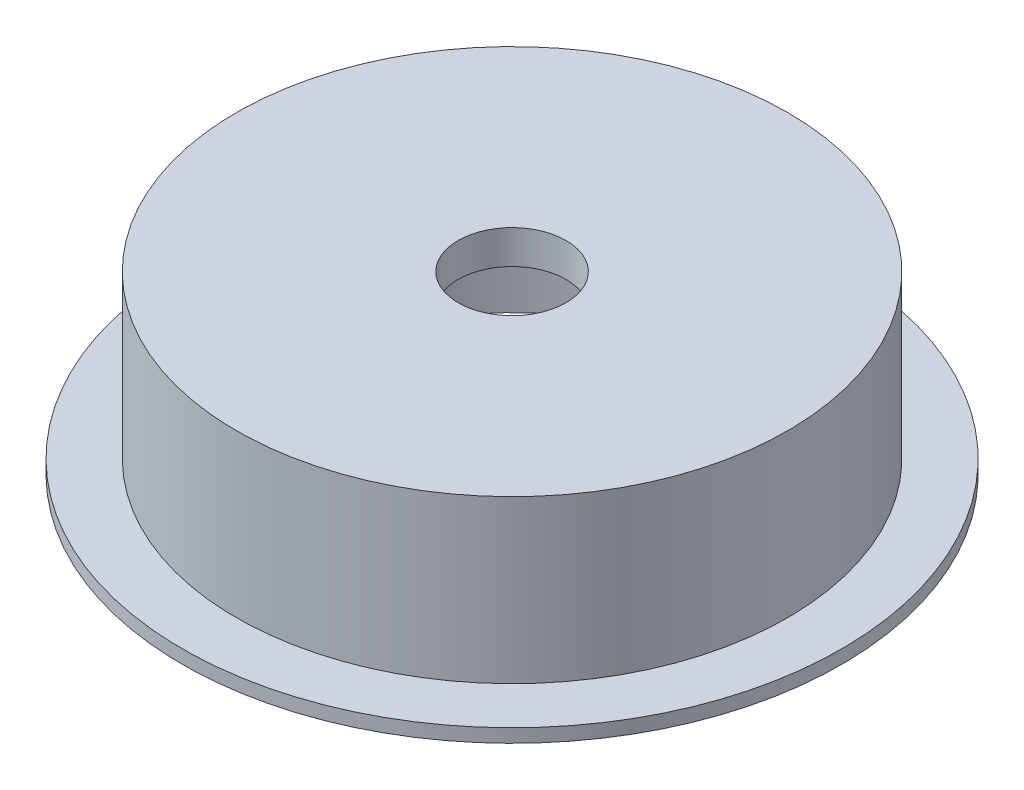
ISO-10303-21;
HEADER;
FILE_DESCRIPTION(('STEP AP214'),'2;1');
FILE_NAME('part.step','',(''),(''),'','','');
FILE_SCHEMA(('AUTOMOTIVE_DESIGN { 1 0 10303 214 1 1 1 1 }'));
ENDSEC;
DATA;
#1=APPLICATION_CONTEXT('core data for automotive mechanical design processes');
#2=APPLICATION_PROTOCOL_DEFINITION('international standard','automotive_design',2000,#1);
#3=PRODUCT_CONTEXT('',#1,'mechanical');
#4=PRODUCT('Part','Part','',(#3));
#5=PRODUCT_RELATED_PRODUCT_CATEGORY('part','',(#4));
#6=PRODUCT_DEFINITION_FORMATION('','',#4);
#7=PRODUCT_DEFINITION_CONTEXT('part definition',#1,'design');
#8=PRODUCT_DEFINITION('design','',#6,#7);
#9=PRODUCT_DEFINITION_SHAPE('','',#8);
#10=(LENGTH_UNIT() NAMED_UNIT(*) SI_UNIT(.MILLI.,.METRE.));
#11=(NAMED_UNIT(*) PLANE_ANGLE_UNIT() SI_UNIT($,.RADIAN.));
#12=(NAMED_UNIT(*) SI_UNIT($,.STERADIAN.) SOLID_ANGLE_UNIT());
#13=UNCERTAINTY_MEASURE_WITH_UNIT(LENGTH_MEASURE(1.E-05),#10,'distance_accuracy_value','');
#14=(GEOMETRIC_REPRESENTATION_CONTEXT(3) GLOBAL_UNCERTAINTY_ASSIGNED_CONTEXT((#13)) GLOBAL_UNIT_ASSIGNED_CONTEXT((#10,
#11,#12)) REPRESENTATION_CONTEXT('',''));
#15=CARTESIAN_POINT('',(0.,0.,0.));
#16=DIRECTION('',(0.,0.,1.));
#17=DIRECTION('',(1.,0.,0.));
#18=AXIS2_PLACEMENT_3D('',#15,#16,#17);
#19=CARTESIAN_POINT('',(0.,0.,0.));
#20=DIRECTION('',(0.,-1.,0.));
#21=DIRECTION('',(0.,0.,-1.));
#22=AXIS2_PLACEMENT_3D('',#19,#20,#21);
#23=CYLINDRICAL_SURFACE('',#22,17.);
#24=CARTESIAN_POINT('',(0.,0.,0.));
#25=DIRECTION('',(0.,-1.,0.));
#26=DIRECTION('',(0.,0.,-1.));
#27=AXIS2_PLACEMENT_3D('',#24,#25,#26);
#28=CIRCLE('',#27,17.);
#29=CARTESIAN_POINT('',(0.,0.,-17.));
#30=VERTEX_POINT('',#29);
#31=EDGE_CURVE('E10',#30,#30,#28,.T.);
#32=ORIENTED_EDGE('',*,*,#31,.T.);
#33=EDGE_LOOP('',(#32));
#34=FACE_BOUND('',#33,.T.);
#35=CARTESIAN_POINT('',(0.,12.1552964696806,0.));
#36=DIRECTION('',(0.,-1.,0.));
#37=DIRECTION('',(0.,0.,-1.));
#38=AXIS2_PLACEMENT_3D('',#35,#36,#37);
#39=CIRCLE('',#38,17.);
#40=CARTESIAN_POINT('',(0.,12.1552964696806,-17.));
#41=VERTEX_POINT('',#40);
#42=EDGE_CURVE('E76',#41,#41,#39,.T.);
#43=ORIENTED_EDGE('',*,*,#42,.F.);
#44=EDGE_LOOP('',(#43));
#45=FACE_BOUND('',#44,.T.);
#46=ADVANCED_FACE('F33',(#34,#45),#23,.F.);
#47=CARTESIAN_POINT('',(17.,0.,0.));
#48=DIRECTION('',(0.,-1.,0.));
#49=DIRECTION('',(0.,0.,-1.));
#50=AXIS2_PLACEMENT_3D('',#47,#48,#49);
#51=PLANE('',#50);
#52=CARTESIAN_POINT('',(0.,0.,0.));
#53=DIRECTION('',(0.,-1.,0.));
#54=DIRECTION('',(0.,0.,-1.));
#55=AXIS2_PLACEMENT_3D('',#52,#53,#54);
#56=CIRCLE('',#55,18.);
#57=CARTESIAN_POINT('',(0.,0.,-18.));
#58=VERTEX_POINT('',#57);
#59=EDGE_CURVE('E40',#58,#58,#56,.T.);
#60=ORIENTED_EDGE('',*,*,#59,.T.);
#61=EDGE_LOOP('',(#60));
#62=FACE_BOUND('',#61,.T.);
#63=ORIENTED_EDGE('',*,*,#31,.F.);
#64=EDGE_LOOP('',(#63));
#65=FACE_BOUND('',#64,.T.);
#66=ADVANCED_FACE('F85',(#62,#65),#51,.T.);
#67=CARTESIAN_POINT('',(0.,0.,0.));
#68=DIRECTION('',(0.,-1.,0.));
#69=DIRECTION('',(0.,0.,-1.));
#70=AXIS2_PLACEMENT_3D('',#67,#68,#69);
#71=CYLINDRICAL_SURFACE('',#70,18.);
#72=CARTESIAN_POINT('',(0.,1.64756847388312,0.));
#73=DIRECTION('',(0.,-1.,0.));
#74=DIRECTION('',(0.,0.,-1.));
#75=AXIS2_PLACEMENT_3D('',#72,#73,#74);
#76=CIRCLE('',#75,18.);
#77=CARTESIAN_POINT('',(0.,1.64756847388312,-18.));
#78=VERTEX_POINT('',#77);
#79=EDGE_CURVE('E45',#78,#78,#76,.T.);
#80=ORIENTED_EDGE('',*,*,#79,.T.);
#81=EDGE_LOOP('',(#80));
#82=FACE_BOUND('',#81,.T.);
#83=ORIENTED_EDGE('',*,*,#59,.F.);
#84=EDGE_LOOP('',(#83));
#85=FACE_BOUND('',#84,.T.);
#86=ADVANCED_FACE('F89',(#82,#85),#71,.T.);
#87=CARTESIAN_POINT('',(18.,1.64756847388312,0.));
#88=DIRECTION('',(0.,-1.,0.));
#89=DIRECTION('',(0.,0.,-1.));
#90=AXIS2_PLACEMENT_3D('',#87,#88,#89);
#91=PLANE('',#90);
#92=CARTESIAN_POINT('',(0.,1.64756847388312,0.));
#93=DIRECTION('',(0.,-1.,0.));
#94=DIRECTION('',(0.,0.,-1.));
#95=AXIS2_PLACEMENT_3D('',#92,#93,#94);
#96=CIRCLE('',#95,24.4324874803171);
#97=CARTESIAN_POINT('',(0.,1.64756847388312,-24.4324874803171));
#98=VERTEX_POINT('',#97);
#99=EDGE_CURVE('E50',#98,#98,#96,.T.);
#100=ORIENTED_EDGE('',*,*,#99,.T.);
#101=EDGE_LOOP('',(#100));
#102=FACE_BOUND('',#101,.T.);
#103=ORIENTED_EDGE('',*,*,#79,.F.);
#104=EDGE_LOOP('',(#103));
#105=FACE_BOUND('',#104,.T.);
#106=ADVANCED_FACE('F93',(#102,#105),#91,.T.);
#107=CARTESIAN_POINT('',(0.,0.,0.));
#108=DIRECTION('',(0.,-1.,0.));
#109=DIRECTION('',(0.,0.,-1.));
#110=AXIS2_PLACEMENT_3D('',#107,#108,#109);
#111=CYLINDRICAL_SURFACE('',#110,24.4324874803171);
#112=CARTESIAN_POINT('',(0.,2.64756847388312,0.));
#113=DIRECTION('',(0.,-1.,0.));
#114=DIRECTION('',(0.,0.,-1.));
#115=AXIS2_PLACEMENT_3D('',#112,#113,#114);
#116=CIRCLE('',#115,24.4324874803171);
#117=CARTESIAN_POINT('',(0.,2.64756847388312,-24.4324874803171));
#118=VERTEX_POINT('',#117);
#119=EDGE_CURVE('E56',#118,#118,#116,.T.);
#120=ORIENTED_EDGE('',*,*,#119,.T.);
#121=EDGE_LOOP('',(#120));
#122=FACE_BOUND('',#121,.T.);
#123=ORIENTED_EDGE('',*,*,#99,.F.);
#124=EDGE_LOOP('',(#123));
#125=FACE_BOUND('',#124,.T.);
#126=ADVANCED_FACE('F100',(#122,#125),#111,.T.);
#127=CARTESIAN_POINT('',(24.4324874803171,2.64756847388312,0.));
#128=DIRECTION('',(0.,1.,0.));
#129=DIRECTION('',(0.,0.,1.));
#130=AXIS2_PLACEMENT_3D('',#127,#128,#129);
#131=PLANE('',#130);
#132=CARTESIAN_POINT('',(0.,2.64756847388312,0.));
#133=DIRECTION('',(0.,-1.,0.));
#134=DIRECTION('',(0.,0.,-1.));
#135=AXIS2_PLACEMENT_3D('',#132,#133,#134);
#136=CIRCLE('',#135,20.4324874803171);
#137=CARTESIAN_POINT('',(0.,2.64756847388312,-20.4324874803171));
#138=VERTEX_POINT('',#137);
#139=EDGE_CURVE('E60',#138,#138,#136,.T.);
#140=ORIENTED_EDGE('',*,*,#139,.T.);
#141=EDGE_LOOP('',(#140));
#142=FACE_BOUND('',#141,.T.);
#143=ORIENTED_EDGE('',*,*,#119,.F.);
#144=EDGE_LOOP('',(#143));
#145=FACE_BOUND('',#144,.T.);
#146=ADVANCED_FACE('F104',(#142,#145),#131,.T.);
#147=CARTESIAN_POINT('',(0.,0.,0.));
#148=DIRECTION('',(0.,-1.,0.));
#149=DIRECTION('',(0.,0.,-1.));
#150=AXIS2_PLACEMENT_3D('',#147,#148,#149);
#151=CYLINDRICAL_SURFACE('',#150,20.4324874803171);
#152=CARTESIAN_POINT('',(0.,14.6552964696806,0.));
#153=DIRECTION('',(0.,-1.,0.));
#154=DIRECTION('',(0.,0.,-1.));
#155=AXIS2_PLACEMENT_3D('',#152,#153,#154);
#156=CIRCLE('',#155,20.4324874803171);
#157=CARTESIAN_POINT('',(0.,14.6552964696806,-20.4324874803171));
#158=VERTEX_POINT('',#157);
#159=EDGE_CURVE('E64',#158,#158,#156,.T.);
#160=ORIENTED_EDGE('',*,*,#159,.T.);
#161=EDGE_LOOP('',(#160));
#162=FACE_BOUND('',#161,.T.);
#163=ORIENTED_EDGE('',*,*,#139,.F.);
#164=EDGE_LOOP('',(#163));
#165=FACE_BOUND('',#164,.T.);
#166=ADVANCED_FACE('F108',(#162,#165),#151,.T.);
#167=CARTESIAN_POINT('',(20.4324874803171,14.6552964696806,0.));
#168=DIRECTION('',(0.,1.,0.));
#169=DIRECTION('',(0.,0.,1.));
#170=AXIS2_PLACEMENT_3D('',#167,#168,#169);
#171=PLANE('',#170);
#172=CARTESIAN_POINT('',(0.,14.6552964696806,0.));
#173=DIRECTION('',(0.,-1.,0.));
#174=DIRECTION('',(0.,0.,-1.));
#175=AXIS2_PLACEMENT_3D('',#172,#173,#174);
#176=CIRCLE('',#175,4.);
#177=CARTESIAN_POINT('',(0.,14.6552964696806,-4.));
#178=VERTEX_POINT('',#177);
#179=EDGE_CURVE('E68',#178,#178,#176,.T.);
#180=ORIENTED_EDGE('',*,*,#179,.T.);
#181=EDGE_LOOP('',(#180));
#182=FACE_BOUND('',#181,.T.);
#183=ORIENTED_EDGE('',*,*,#159,.F.);
#184=EDGE_LOOP('',(#183));
#185=FACE_BOUND('',#184,.T.);
#186=ADVANCED_FACE('F112',(#182,#185),#171,.T.);
#187=CARTESIAN_POINT('',(0.,0.,0.));
#188=DIRECTION('',(0.,-1.,0.));
#189=DIRECTION('',(0.,0.,-1.));
#190=AXIS2_PLACEMENT_3D('',#187,#188,#189);
#191=CYLINDRICAL_SURFACE('',#190,4.);
#192=CARTESIAN_POINT('',(0.,12.1552964696806,0.));
#193=DIRECTION('',(0.,-1.,0.));
#194=DIRECTION('',(0.,0.,-1.));
#195=AXIS2_PLACEMENT_3D('',#192,#193,#194);
#196=CIRCLE('',#195,4.);
#197=CARTESIAN_POINT('',(0.,12.1552964696806,-4.));
#198=VERTEX_POINT('',#197);
#199=EDGE_CURVE('E72',#198,#198,#196,.T.);
#200=ORIENTED_EDGE('',*,*,#199,.T.);
#201=EDGE_LOOP('',(#200));
#202=FACE_BOUND('',#201,.T.);
#203=ORIENTED_EDGE('',*,*,#179,.F.);
#204=EDGE_LOOP('',(#203));
#205=FACE_BOUND('',#204,.T.);
#206=ADVANCED_FACE('F116',(#202,#205),#191,.F.);
#207=CARTESIAN_POINT('',(4.,12.1552964696806,0.));
#208=DIRECTION('',(0.,-1.,0.));
#209=DIRECTION('',(0.,0.,-1.));
#210=AXIS2_PLACEMENT_3D('',#207,#208,#209);
#211=PLANE('',#210);
#212=ORIENTED_EDGE('',*,*,#42,.T.);
#213=EDGE_LOOP('',(#212));
#214=FACE_BOUND('',#213,.T.);
#215=ORIENTED_EDGE('',*,*,#199,.F.);
#216=EDGE_LOOP('',(#215));
#217=FACE_BOUND('',#216,.T.);
#218=ADVANCED_FACE('F81',(#214,#217),#211,.T.);
#219=CLOSED_SHELL('',(#46,#66,#86,#106,#126,#146,#166,#186,#206,#218));
#220=MANIFOLD_SOLID_BREP('B2',#219);
#221=ADVANCED_BREP_SHAPE_REPRESENTATION('',(#18,#220),#14);
#222=SHAPE_DEFINITION_REPRESENTATION(#9,#221);
ENDSEC;
END-ISO-10303-21;
